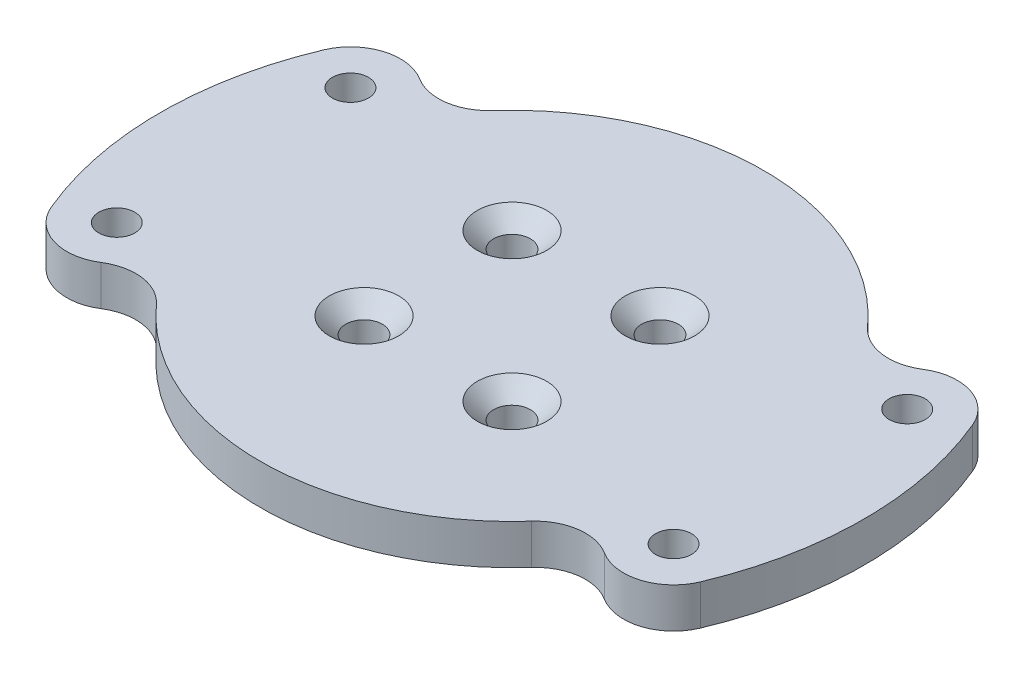
ISO-10303-21;
HEADER;
FILE_DESCRIPTION(('STEP AP214'),'2;1');
FILE_NAME('part.step','',(''),(''),'','','');
FILE_SCHEMA(('AUTOMOTIVE_DESIGN { 1 0 10303 214 1 1 1 1 }'));
ENDSEC;
DATA;
#1=APPLICATION_CONTEXT('core data for automotive mechanical design processes');
#2=APPLICATION_PROTOCOL_DEFINITION('international standard','automotive_design',2000,#1);
#3=PRODUCT_CONTEXT('',#1,'mechanical');
#4=PRODUCT('Part','Part','',(#3));
#5=PRODUCT_RELATED_PRODUCT_CATEGORY('part','',(#4));
#6=PRODUCT_DEFINITION_FORMATION('','',#4);
#7=PRODUCT_DEFINITION_CONTEXT('part definition',#1,'design');
#8=PRODUCT_DEFINITION('design','',#6,#7);
#9=PRODUCT_DEFINITION_SHAPE('','',#8);
#10=(LENGTH_UNIT() NAMED_UNIT(*) SI_UNIT(.MILLI.,.METRE.));
#11=(NAMED_UNIT(*) PLANE_ANGLE_UNIT() SI_UNIT($,.RADIAN.));
#12=(NAMED_UNIT(*) SI_UNIT($,.STERADIAN.) SOLID_ANGLE_UNIT());
#13=UNCERTAINTY_MEASURE_WITH_UNIT(LENGTH_MEASURE(1.E-05),#10,'distance_accuracy_value','');
#14=(GEOMETRIC_REPRESENTATION_CONTEXT(3) GLOBAL_UNCERTAINTY_ASSIGNED_CONTEXT((#13)) GLOBAL_UNIT_ASSIGNED_CONTEXT((#10,
#11,#12)) REPRESENTATION_CONTEXT('',''));
#15=CARTESIAN_POINT('',(0.,0.,0.));
#16=DIRECTION('',(0.,0.,1.));
#17=DIRECTION('',(1.,0.,0.));
#18=AXIS2_PLACEMENT_3D('',#15,#16,#17);
#19=CARTESIAN_POINT('',(0.,6.,0.));
#20=DIRECTION('',(0.,-1.,0.));
#21=DIRECTION('',(0.,0.,-1.));
#22=AXIS2_PLACEMENT_3D('',#19,#20,#21);
#23=PLANE('',#22);
#24=CARTESIAN_POINT('',(-11.0838987950992,6.,-11.0838987950991));
#25=DIRECTION('',(0.,1.,0.));
#26=DIRECTION('',(0.,0.,1.));
#27=AXIS2_PLACEMENT_3D('',#24,#25,#26);
#28=CIRCLE('',#27,5.2);
#29=CARTESIAN_POINT('',(-11.0838987950992,6.,-5.88389879509911));
#30=VERTEX_POINT('',#29);
#31=EDGE_CURVE('E543',#30,#30,#28,.T.);
#32=ORIENTED_EDGE('',*,*,#31,.F.);
#33=EDGE_LOOP('',(#32));
#34=FACE_BOUND('',#33,.T.);
#35=CARTESIAN_POINT('',(11.0838987950991,6.,-11.0838987950992));
#36=DIRECTION('',(0.,1.,0.));
#37=DIRECTION('',(0.,0.,1.));
#38=AXIS2_PLACEMENT_3D('',#35,#36,#37);
#39=CIRCLE('',#38,5.2);
#40=CARTESIAN_POINT('',(11.0838987950991,6.,-5.88389879509915));
#41=VERTEX_POINT('',#40);
#42=EDGE_CURVE('E550',#41,#41,#39,.T.);
#43=ORIENTED_EDGE('',*,*,#42,.F.);
#44=EDGE_LOOP('',(#43));
#45=FACE_BOUND('',#44,.T.);
#46=CARTESIAN_POINT('',(11.0838987950992,6.,11.0838987950991));
#47=DIRECTION('',(0.,1.,0.));
#48=DIRECTION('',(0.,0.,1.));
#49=AXIS2_PLACEMENT_3D('',#46,#47,#48);
#50=CIRCLE('',#49,5.2);
#51=CARTESIAN_POINT('',(11.0838987950992,6.,16.2838987950991));
#52=VERTEX_POINT('',#51);
#53=EDGE_CURVE('E559',#52,#52,#50,.T.);
#54=ORIENTED_EDGE('',*,*,#53,.F.);
#55=EDGE_LOOP('',(#54));
#56=FACE_BOUND('',#55,.T.);
#57=CARTESIAN_POINT('',(-11.0838987950991,6.,11.0838987950992));
#58=DIRECTION('',(0.,1.,0.));
#59=DIRECTION('',(0.,0.,1.));
#60=AXIS2_PLACEMENT_3D('',#57,#58,#59);
#61=CIRCLE('',#60,5.2);
#62=CARTESIAN_POINT('',(-11.0838987950991,6.,16.2838987950992));
#63=VERTEX_POINT('',#62);
#64=EDGE_CURVE('E227',#63,#63,#61,.T.);
#65=ORIENTED_EDGE('',*,*,#64,.F.);
#66=EDGE_LOOP('',(#65));
#67=FACE_BOUND('',#66,.T.);
#68=CARTESIAN_POINT('',(-41.7019259147584,6.,-17.5));
#69=DIRECTION('',(0.,1.,0.));
#70=DIRECTION('',(0.,0.,-1.));
#71=AXIS2_PLACEMENT_3D('',#68,#69,#70);
#72=CIRCLE('',#71,2.7);
#73=CARTESIAN_POINT('',(-41.7019259147584,6.,-20.2));
#74=VERTEX_POINT('',#73);
#75=EDGE_CURVE('E237',#74,#74,#72,.T.);
#76=ORIENTED_EDGE('',*,*,#75,.F.);
#77=EDGE_LOOP('',(#76));
#78=FACE_BOUND('',#77,.T.);
#79=CARTESIAN_POINT('',(0.,6.,0.));
#80=DIRECTION('',(0.,1.,0.));
#81=DIRECTION('',(0.,0.,1.));
#82=AXIS2_PLACEMENT_3D('',#79,#80,#81);
#83=CIRCLE('',#82,37.725);
#84=CARTESIAN_POINT('',(-28.0981033127079,6.,25.1728467843506));
#85=VERTEX_POINT('',#84);
#86=CARTESIAN_POINT('',(28.0981033127079,6.,25.1728467843506));
#87=VERTEX_POINT('',#86);
#88=EDGE_CURVE('E165',#85,#87,#83,.T.);
#89=ORIENTED_EDGE('',*,*,#88,.T.);
#90=CARTESIAN_POINT('',(33.6842073510197,6.,30.1773888885953));
#91=DIRECTION('',(0.,-1.,0.));
#92=DIRECTION('',(0.,0.,-1.));
#93=AXIS2_PLACEMENT_3D('',#90,#91,#92);
#94=CIRCLE('',#93,7.5);
#95=CARTESIAN_POINT('',(37.693066632889,6.,23.8386944442976));
#96=VERTEX_POINT('',#95);
#97=EDGE_CURVE('E52',#87,#96,#94,.T.);
#98=ORIENTED_EDGE('',*,*,#97,.T.);
#99=CARTESIAN_POINT('',(41.7019259147584,6.,17.5));
#100=DIRECTION('',(0.,-1.,0.));
#101=DIRECTION('',(0.,0.,-1.));
#102=AXIS2_PLACEMENT_3D('',#99,#100,#101);
#103=CIRCLE('',#102,7.5);
#104=CARTESIAN_POINT('',(48.6176681891794,6.,20.4021558872305));
#105=VERTEX_POINT('',#104);
#106=EDGE_CURVE('E181',#96,#105,#103,.F.);
#107=ORIENTED_EDGE('',*,*,#106,.T.);
#108=CARTESIAN_POINT('',(0.,6.,0.));
#109=DIRECTION('',(0.,1.,0.));
#110=DIRECTION('',(0.,0.,-1.));
#111=AXIS2_PLACEMENT_3D('',#108,#109,#110);
#112=CIRCLE('',#111,52.725);
#113=CARTESIAN_POINT('',(48.6176681891794,6.,-20.4021558872305));
#114=VERTEX_POINT('',#113);
#115=EDGE_CURVE('E147',#105,#114,#112,.T.);
#116=ORIENTED_EDGE('',*,*,#115,.T.);
#117=CARTESIAN_POINT('',(41.7019259147584,6.,-17.5));
#118=DIRECTION('',(0.,-1.,0.));
#119=DIRECTION('',(0.,0.,-1.));
#120=AXIS2_PLACEMENT_3D('',#117,#118,#119);
#121=CIRCLE('',#120,7.5);
#122=CARTESIAN_POINT('',(37.693066632889,6.,-23.8386944442976));
#123=VERTEX_POINT('',#122);
#124=EDGE_CURVE('E177',#114,#123,#121,.F.);
#125=ORIENTED_EDGE('',*,*,#124,.T.);
#126=CARTESIAN_POINT('',(33.6842073510197,6.,-30.1773888885953));
#127=DIRECTION('',(0.,-1.,0.));
#128=DIRECTION('',(0.,0.,-1.));
#129=AXIS2_PLACEMENT_3D('',#126,#127,#128);
#130=CIRCLE('',#129,7.5);
#131=CARTESIAN_POINT('',(28.0981033127079,6.,-25.1728467843506));
#132=VERTEX_POINT('',#131);
#133=EDGE_CURVE('E205',#123,#132,#130,.T.);
#134=ORIENTED_EDGE('',*,*,#133,.T.);
#135=CARTESIAN_POINT('',(0.,6.,0.));
#136=DIRECTION('',(0.,1.,0.));
#137=DIRECTION('',(0.,0.,-1.));
#138=AXIS2_PLACEMENT_3D('',#135,#136,#137);
#139=CIRCLE('',#138,37.725);
#140=CARTESIAN_POINT('',(-28.0981033127079,6.,-25.1728467843506));
#141=VERTEX_POINT('',#140);
#142=EDGE_CURVE('E251',#132,#141,#139,.T.);
#143=ORIENTED_EDGE('',*,*,#142,.T.);
#144=CARTESIAN_POINT('',(-33.6842073510197,6.,-30.1773888885953));
#145=DIRECTION('',(0.,-1.,0.));
#146=DIRECTION('',(0.,0.,-1.));
#147=AXIS2_PLACEMENT_3D('',#144,#145,#146);
#148=CIRCLE('',#147,7.5);
#149=CARTESIAN_POINT('',(-37.693066632889,6.,-23.8386944442976));
#150=VERTEX_POINT('',#149);
#151=EDGE_CURVE('E11',#141,#150,#148,.T.);
#152=ORIENTED_EDGE('',*,*,#151,.T.);
#153=CARTESIAN_POINT('',(-41.7019259147584,6.,-17.5));
#154=DIRECTION('',(0.,-1.,0.));
#155=DIRECTION('',(0.,0.,-1.));
#156=AXIS2_PLACEMENT_3D('',#153,#154,#155);
#157=CIRCLE('',#156,7.5);
#158=CARTESIAN_POINT('',(-48.6176681891794,6.,-20.4021558872305));
#159=VERTEX_POINT('',#158);
#160=EDGE_CURVE('E136',#150,#159,#157,.F.);
#161=ORIENTED_EDGE('',*,*,#160,.T.);
#162=CARTESIAN_POINT('',(0.,6.,0.));
#163=DIRECTION('',(0.,1.,0.));
#164=DIRECTION('',(0.,0.,1.));
#165=AXIS2_PLACEMENT_3D('',#162,#163,#164);
#166=CIRCLE('',#165,52.725);
#167=CARTESIAN_POINT('',(-48.6176681891794,6.,20.4021558872305));
#168=VERTEX_POINT('',#167);
#169=EDGE_CURVE('E253',#159,#168,#166,.T.);
#170=ORIENTED_EDGE('',*,*,#169,.T.);
#171=CARTESIAN_POINT('',(-41.7019259147584,6.,17.5));
#172=DIRECTION('',(0.,-1.,0.));
#173=DIRECTION('',(0.,0.,-1.));
#174=AXIS2_PLACEMENT_3D('',#171,#172,#173);
#175=CIRCLE('',#174,7.5);
#176=CARTESIAN_POINT('',(-37.693066632889,6.,23.8386944442976));
#177=VERTEX_POINT('',#176);
#178=EDGE_CURVE('E179',#168,#177,#175,.F.);
#179=ORIENTED_EDGE('',*,*,#178,.T.);
#180=CARTESIAN_POINT('',(-33.6842073510197,6.,30.1773888885953));
#181=DIRECTION('',(0.,-1.,0.));
#182=DIRECTION('',(0.,0.,-1.));
#183=AXIS2_PLACEMENT_3D('',#180,#181,#182);
#184=CIRCLE('',#183,7.5);
#185=EDGE_CURVE('E201',#177,#85,#184,.T.);
#186=ORIENTED_EDGE('',*,*,#185,.T.);
#187=EDGE_LOOP('',(#89,#98,#107,#116,#125,#134,#143,#152,#161,#170,#179,#186));
#188=FACE_BOUND('',#187,.T.);
#189=CARTESIAN_POINT('',(41.7019259147584,6.,-17.5));
#190=DIRECTION('',(0.,1.,0.));
#191=DIRECTION('',(0.,0.,1.));
#192=AXIS2_PLACEMENT_3D('',#189,#190,#191);
#193=CIRCLE('',#192,2.7);
#194=CARTESIAN_POINT('',(41.7019259147584,6.,-14.8));
#195=VERTEX_POINT('',#194);
#196=EDGE_CURVE('E156',#195,#195,#193,.T.);
#197=ORIENTED_EDGE('',*,*,#196,.F.);
#198=EDGE_LOOP('',(#197));
#199=FACE_BOUND('',#198,.T.);
#200=CARTESIAN_POINT('',(41.7019259147584,6.,17.5));
#201=DIRECTION('',(0.,1.,0.));
#202=DIRECTION('',(0.,0.,1.));
#203=AXIS2_PLACEMENT_3D('',#200,#201,#202);
#204=CIRCLE('',#203,2.7);
#205=CARTESIAN_POINT('',(41.7019259147584,6.,20.2));
#206=VERTEX_POINT('',#205);
#207=EDGE_CURVE('E243',#206,#206,#204,.T.);
#208=ORIENTED_EDGE('',*,*,#207,.F.);
#209=EDGE_LOOP('',(#208));
#210=FACE_BOUND('',#209,.T.);
#211=CARTESIAN_POINT('',(-41.7019259147584,6.,17.5));
#212=DIRECTION('',(0.,1.,0.));
#213=DIRECTION('',(0.,0.,-1.));
#214=AXIS2_PLACEMENT_3D('',#211,#212,#213);
#215=CIRCLE('',#214,2.7);
#216=CARTESIAN_POINT('',(-41.7019259147584,6.,14.8));
#217=VERTEX_POINT('',#216);
#218=EDGE_CURVE('E231',#217,#217,#215,.T.);
#219=ORIENTED_EDGE('',*,*,#218,.F.);
#220=EDGE_LOOP('',(#219));
#221=FACE_BOUND('',#220,.T.);
#222=ADVANCED_FACE('F35',(#34,#45,#56,#67,#78,#188,#199,#210,#221),#23,.F.);
#223=CARTESIAN_POINT('',(0.,0.,0.));
#224=DIRECTION('',(0.,-1.,0.));
#225=DIRECTION('',(0.,0.,-1.));
#226=AXIS2_PLACEMENT_3D('',#223,#224,#225);
#227=PLANE('',#226);
#228=CARTESIAN_POINT('',(-11.0838987950992,0.,-11.0838987950991));
#229=DIRECTION('',(0.,1.,0.));
#230=DIRECTION('',(0.,0.,1.));
#231=AXIS2_PLACEMENT_3D('',#228,#229,#230);
#232=CIRCLE('',#231,2.75);
#233=CARTESIAN_POINT('',(-11.0838987950992,0.,-8.33389879509911));
#234=VERTEX_POINT('',#233);
#235=EDGE_CURVE('E545',#234,#234,#232,.T.);
#236=ORIENTED_EDGE('',*,*,#235,.T.);
#237=EDGE_LOOP('',(#236));
#238=FACE_BOUND('',#237,.T.);
#239=CARTESIAN_POINT('',(11.0838987950991,0.,-11.0838987950992));
#240=DIRECTION('',(0.,1.,0.));
#241=DIRECTION('',(0.,0.,1.));
#242=AXIS2_PLACEMENT_3D('',#239,#240,#241);
#243=CIRCLE('',#242,2.75);
#244=CARTESIAN_POINT('',(11.0838987950991,0.,-8.33389879509916));
#245=VERTEX_POINT('',#244);
#246=EDGE_CURVE('E556',#245,#245,#243,.T.);
#247=ORIENTED_EDGE('',*,*,#246,.T.);
#248=EDGE_LOOP('',(#247));
#249=FACE_BOUND('',#248,.T.);
#250=CARTESIAN_POINT('',(11.0838987950992,0.,11.0838987950991));
#251=DIRECTION('',(0.,1.,0.));
#252=DIRECTION('',(0.,0.,1.));
#253=AXIS2_PLACEMENT_3D('',#250,#251,#252);
#254=CIRCLE('',#253,2.75);
#255=CARTESIAN_POINT('',(11.0838987950992,0.,13.8338987950991));
#256=VERTEX_POINT('',#255);
#257=EDGE_CURVE('E565',#256,#256,#254,.T.);
#258=ORIENTED_EDGE('',*,*,#257,.T.);
#259=EDGE_LOOP('',(#258));
#260=FACE_BOUND('',#259,.T.);
#261=CARTESIAN_POINT('',(-11.0838987950991,0.,11.0838987950992));
#262=DIRECTION('',(0.,1.,0.));
#263=DIRECTION('',(0.,0.,1.));
#264=AXIS2_PLACEMENT_3D('',#261,#262,#263);
#265=CIRCLE('',#264,2.75);
#266=CARTESIAN_POINT('',(-11.0838987950991,0.,13.8338987950992));
#267=VERTEX_POINT('',#266);
#268=EDGE_CURVE('E217',#267,#267,#265,.T.);
#269=ORIENTED_EDGE('',*,*,#268,.T.);
#270=EDGE_LOOP('',(#269));
#271=FACE_BOUND('',#270,.T.);
#272=CARTESIAN_POINT('',(-41.7019259147584,0.,-17.5));
#273=DIRECTION('',(0.,1.,0.));
#274=DIRECTION('',(0.,0.,-1.));
#275=AXIS2_PLACEMENT_3D('',#272,#273,#274);
#276=CIRCLE('',#275,2.7);
#277=CARTESIAN_POINT('',(-41.7019259147584,0.,-20.2));
#278=VERTEX_POINT('',#277);
#279=EDGE_CURVE('E234',#278,#278,#276,.T.);
#280=ORIENTED_EDGE('',*,*,#279,.T.);
#281=EDGE_LOOP('',(#280));
#282=FACE_BOUND('',#281,.T.);
#283=CARTESIAN_POINT('',(0.,0.,0.));
#284=DIRECTION('',(0.,1.,0.));
#285=DIRECTION('',(0.,0.,-1.));
#286=AXIS2_PLACEMENT_3D('',#283,#284,#285);
#287=CIRCLE('',#286,52.725);
#288=CARTESIAN_POINT('',(48.6176681891794,0.,20.4021558872305));
#289=VERTEX_POINT('',#288);
#290=CARTESIAN_POINT('',(48.6176681891794,0.,-20.4021558872305));
#291=VERTEX_POINT('',#290);
#292=EDGE_CURVE('E144',#289,#291,#287,.T.);
#293=ORIENTED_EDGE('',*,*,#292,.F.);
#294=CARTESIAN_POINT('',(41.7019259147584,0.,17.5));
#295=DIRECTION('',(0.,-1.,0.));
#296=DIRECTION('',(0.,0.,-1.));
#297=AXIS2_PLACEMENT_3D('',#294,#295,#296);
#298=CIRCLE('',#297,7.5);
#299=CARTESIAN_POINT('',(37.693066632889,0.,23.8386944442976));
#300=VERTEX_POINT('',#299);
#301=EDGE_CURVE('E127',#289,#300,#298,.T.);
#302=ORIENTED_EDGE('',*,*,#301,.T.);
#303=CARTESIAN_POINT('',(33.6842073510197,0.,30.1773888885953));
#304=DIRECTION('',(0.,-1.,0.));
#305=DIRECTION('',(0.,0.,-1.));
#306=AXIS2_PLACEMENT_3D('',#303,#304,#305);
#307=CIRCLE('',#306,7.5);
#308=CARTESIAN_POINT('',(28.0981033127079,0.,25.1728467843506));
#309=VERTEX_POINT('',#308);
#310=EDGE_CURVE('E196',#300,#309,#307,.F.);
#311=ORIENTED_EDGE('',*,*,#310,.T.);
#312=CARTESIAN_POINT('',(0.,0.,0.));
#313=DIRECTION('',(0.,1.,0.));
#314=DIRECTION('',(0.,0.,1.));
#315=AXIS2_PLACEMENT_3D('',#312,#313,#314);
#316=CIRCLE('',#315,37.725);
#317=CARTESIAN_POINT('',(-28.0981033127079,0.,25.1728467843506));
#318=VERTEX_POINT('',#317);
#319=EDGE_CURVE('E170',#318,#309,#316,.T.);
#320=ORIENTED_EDGE('',*,*,#319,.F.);
#321=CARTESIAN_POINT('',(-33.6842073510197,0.,30.1773888885953));
#322=DIRECTION('',(0.,-1.,0.));
#323=DIRECTION('',(0.,0.,-1.));
#324=AXIS2_PLACEMENT_3D('',#321,#322,#323);
#325=CIRCLE('',#324,7.5);
#326=CARTESIAN_POINT('',(-37.693066632889,0.,23.8386944442976));
#327=VERTEX_POINT('',#326);
#328=EDGE_CURVE('E199',#318,#327,#325,.F.);
#329=ORIENTED_EDGE('',*,*,#328,.T.);
#330=CARTESIAN_POINT('',(-41.7019259147584,0.,17.5));
#331=DIRECTION('',(0.,-1.,0.));
#332=DIRECTION('',(0.,0.,-1.));
#333=AXIS2_PLACEMENT_3D('',#330,#331,#332);
#334=CIRCLE('',#333,7.5);
#335=CARTESIAN_POINT('',(-48.6176681891794,0.,20.4021558872305));
#336=VERTEX_POINT('',#335);
#337=EDGE_CURVE('E137',#327,#336,#334,.T.);
#338=ORIENTED_EDGE('',*,*,#337,.T.);
#339=CARTESIAN_POINT('',(0.,0.,0.));
#340=DIRECTION('',(0.,1.,0.));
#341=DIRECTION('',(0.,0.,1.));
#342=AXIS2_PLACEMENT_3D('',#339,#340,#341);
#343=CIRCLE('',#342,52.725);
#344=CARTESIAN_POINT('',(-48.6176681891794,0.,-20.4021558872305));
#345=VERTEX_POINT('',#344);
#346=EDGE_CURVE('E159',#345,#336,#343,.T.);
#347=ORIENTED_EDGE('',*,*,#346,.F.);
#348=CARTESIAN_POINT('',(-41.7019259147584,0.,-17.5));
#349=DIRECTION('',(0.,-1.,0.));
#350=DIRECTION('',(0.,0.,-1.));
#351=AXIS2_PLACEMENT_3D('',#348,#349,#350);
#352=CIRCLE('',#351,7.5);
#353=CARTESIAN_POINT('',(-37.693066632889,0.,-23.8386944442976));
#354=VERTEX_POINT('',#353);
#355=EDGE_CURVE('E148',#345,#354,#352,.T.);
#356=ORIENTED_EDGE('',*,*,#355,.T.);
#357=CARTESIAN_POINT('',(-33.6842073510197,0.,-30.1773888885953));
#358=DIRECTION('',(0.,-1.,0.));
#359=DIRECTION('',(0.,0.,-1.));
#360=AXIS2_PLACEMENT_3D('',#357,#358,#359);
#361=CIRCLE('',#360,7.5);
#362=CARTESIAN_POINT('',(-28.0981033127079,0.,-25.1728467843506));
#363=VERTEX_POINT('',#362);
#364=EDGE_CURVE('E44',#354,#363,#361,.F.);
#365=ORIENTED_EDGE('',*,*,#364,.T.);
#366=CARTESIAN_POINT('',(0.,0.,0.));
#367=DIRECTION('',(0.,1.,0.));
#368=DIRECTION('',(0.,0.,-1.));
#369=AXIS2_PLACEMENT_3D('',#366,#367,#368);
#370=CIRCLE('',#369,37.725);
#371=CARTESIAN_POINT('',(28.0981033127079,0.,-25.1728467843506));
#372=VERTEX_POINT('',#371);
#373=EDGE_CURVE('E155',#372,#363,#370,.T.);
#374=ORIENTED_EDGE('',*,*,#373,.F.);
#375=CARTESIAN_POINT('',(33.6842073510197,0.,-30.1773888885953));
#376=DIRECTION('',(0.,-1.,0.));
#377=DIRECTION('',(0.,0.,-1.));
#378=AXIS2_PLACEMENT_3D('',#375,#376,#377);
#379=CIRCLE('',#378,7.5);
#380=CARTESIAN_POINT('',(37.693066632889,0.,-23.8386944442976));
#381=VERTEX_POINT('',#380);
#382=EDGE_CURVE('E203',#372,#381,#379,.F.);
#383=ORIENTED_EDGE('',*,*,#382,.T.);
#384=CARTESIAN_POINT('',(41.7019259147584,0.,-17.5));
#385=DIRECTION('',(0.,-1.,0.));
#386=DIRECTION('',(0.,0.,-1.));
#387=AXIS2_PLACEMENT_3D('',#384,#385,#386);
#388=CIRCLE('',#387,7.5);
#389=EDGE_CURVE('E154',#381,#291,#388,.T.);
#390=ORIENTED_EDGE('',*,*,#389,.T.);
#391=EDGE_LOOP('',(#293,#302,#311,#320,#329,#338,#347,#356,#365,#374,#383,#390));
#392=FACE_BOUND('',#391,.T.);
#393=CARTESIAN_POINT('',(41.7019259147584,0.,-17.5));
#394=DIRECTION('',(0.,1.,0.));
#395=DIRECTION('',(0.,0.,1.));
#396=AXIS2_PLACEMENT_3D('',#393,#394,#395);
#397=CIRCLE('',#396,2.7);
#398=CARTESIAN_POINT('',(41.7019259147584,0.,-14.8));
#399=VERTEX_POINT('',#398);
#400=EDGE_CURVE('E162',#399,#399,#397,.T.);
#401=ORIENTED_EDGE('',*,*,#400,.T.);
#402=EDGE_LOOP('',(#401));
#403=FACE_BOUND('',#402,.T.);
#404=CARTESIAN_POINT('',(41.7019259147584,0.,17.5));
#405=DIRECTION('',(0.,1.,0.));
#406=DIRECTION('',(0.,0.,1.));
#407=AXIS2_PLACEMENT_3D('',#404,#405,#406);
#408=CIRCLE('',#407,2.7);
#409=CARTESIAN_POINT('',(41.7019259147584,0.,20.2));
#410=VERTEX_POINT('',#409);
#411=EDGE_CURVE('E240',#410,#410,#408,.T.);
#412=ORIENTED_EDGE('',*,*,#411,.T.);
#413=EDGE_LOOP('',(#412));
#414=FACE_BOUND('',#413,.T.);
#415=CARTESIAN_POINT('',(-41.7019259147584,0.,17.5));
#416=DIRECTION('',(0.,1.,0.));
#417=DIRECTION('',(0.,0.,-1.));
#418=AXIS2_PLACEMENT_3D('',#415,#416,#417);
#419=CIRCLE('',#418,2.7);
#420=CARTESIAN_POINT('',(-41.7019259147584,0.,14.8));
#421=VERTEX_POINT('',#420);
#422=EDGE_CURVE('E209',#421,#421,#419,.T.);
#423=ORIENTED_EDGE('',*,*,#422,.T.);
#424=EDGE_LOOP('',(#423));
#425=FACE_BOUND('',#424,.T.);
#426=ADVANCED_FACE('F151',(#238,#249,#260,#271,#282,#392,#403,#414,#425),#227,.T.);
#427=CARTESIAN_POINT('',(0.,6.,0.));
#428=DIRECTION('',(0.,-1.,0.));
#429=DIRECTION('',(0.,0.,-1.));
#430=AXIS2_PLACEMENT_3D('',#427,#428,#429);
#431=CYLINDRICAL_SURFACE('',#430,52.725);
#432=ORIENTED_EDGE('',*,*,#115,.F.);
#433=DIRECTION('',(0.,-1.,0.));
#434=VECTOR('',#433,1.);
#435=CARTESIAN_POINT('',(48.6176681891794,6.,20.4021558872305));
#436=LINE('',#435,#434);
#437=EDGE_CURVE('E131',#105,#289,#436,.T.);
#438=ORIENTED_EDGE('',*,*,#437,.T.);
#439=ORIENTED_EDGE('',*,*,#292,.T.);
#440=DIRECTION('',(0.,-1.,0.));
#441=VECTOR('',#440,1.);
#442=CARTESIAN_POINT('',(48.6176681891794,6.,-20.4021558872305));
#443=LINE('',#442,#441);
#444=EDGE_CURVE('E149',#291,#114,#443,.F.);
#445=ORIENTED_EDGE('',*,*,#444,.T.);
#446=EDGE_LOOP('',(#432,#438,#439,#445));
#447=FACE_BOUND('',#446,.T.);
#448=ADVANCED_FACE('F142',(#447),#431,.T.);
#449=CARTESIAN_POINT('',(0.,6.,0.));
#450=DIRECTION('',(0.,-1.,0.));
#451=DIRECTION('',(0.,0.,-1.));
#452=AXIS2_PLACEMENT_3D('',#449,#450,#451);
#453=CYLINDRICAL_SURFACE('',#452,37.725);
#454=ORIENTED_EDGE('',*,*,#142,.F.);
#455=DIRECTION('',(0.,-1.,0.));
#456=VECTOR('',#455,1.);
#457=CARTESIAN_POINT('',(28.0981033127079,6.,-25.1728467843506));
#458=LINE('',#457,#456);
#459=EDGE_CURVE('E194',#132,#372,#458,.T.);
#460=ORIENTED_EDGE('',*,*,#459,.T.);
#461=ORIENTED_EDGE('',*,*,#373,.T.);
#462=DIRECTION('',(0.,-1.,0.));
#463=VECTOR('',#462,1.);
#464=CARTESIAN_POINT('',(-28.0981033127079,6.,-25.1728467843506));
#465=LINE('',#464,#463);
#466=EDGE_CURVE('E192',#363,#141,#465,.F.);
#467=ORIENTED_EDGE('',*,*,#466,.T.);
#468=EDGE_LOOP('',(#454,#460,#461,#467));
#469=FACE_BOUND('',#468,.T.);
#470=ADVANCED_FACE('F269',(#469),#453,.T.);
#471=CARTESIAN_POINT('',(0.,6.,0.));
#472=DIRECTION('',(0.,-1.,0.));
#473=DIRECTION('',(0.,0.,-1.));
#474=AXIS2_PLACEMENT_3D('',#471,#472,#473);
#475=CYLINDRICAL_SURFACE('',#474,52.725);
#476=ORIENTED_EDGE('',*,*,#346,.T.);
#477=DIRECTION('',(0.,-1.,0.));
#478=VECTOR('',#477,1.);
#479=CARTESIAN_POINT('',(-48.6176681891794,6.,20.4021558872305));
#480=LINE('',#479,#478);
#481=EDGE_CURVE('E189',#336,#168,#480,.F.);
#482=ORIENTED_EDGE('',*,*,#481,.T.);
#483=ORIENTED_EDGE('',*,*,#169,.F.);
#484=DIRECTION('',(0.,-1.,0.));
#485=VECTOR('',#484,1.);
#486=CARTESIAN_POINT('',(-48.6176681891794,6.,-20.4021558872305));
#487=LINE('',#486,#485);
#488=EDGE_CURVE('E186',#159,#345,#487,.T.);
#489=ORIENTED_EDGE('',*,*,#488,.T.);
#490=EDGE_LOOP('',(#476,#482,#483,#489));
#491=FACE_BOUND('',#490,.T.);
#492=ADVANCED_FACE('F277',(#491),#475,.T.);
#493=CARTESIAN_POINT('',(0.,6.,0.));
#494=DIRECTION('',(0.,-1.,0.));
#495=DIRECTION('',(0.,0.,-1.));
#496=AXIS2_PLACEMENT_3D('',#493,#494,#495);
#497=CYLINDRICAL_SURFACE('',#496,37.725);
#498=ORIENTED_EDGE('',*,*,#319,.T.);
#499=DIRECTION('',(0.,-1.,0.));
#500=VECTOR('',#499,1.);
#501=CARTESIAN_POINT('',(28.0981033127079,6.,25.1728467843506));
#502=LINE('',#501,#500);
#503=EDGE_CURVE('E60',#309,#87,#502,.F.);
#504=ORIENTED_EDGE('',*,*,#503,.T.);
#505=ORIENTED_EDGE('',*,*,#88,.F.);
#506=DIRECTION('',(0.,-1.,0.));
#507=VECTOR('',#506,1.);
#508=CARTESIAN_POINT('',(-28.0981033127079,6.,25.1728467843506));
#509=LINE('',#508,#507);
#510=EDGE_CURVE('E183',#85,#318,#509,.T.);
#511=ORIENTED_EDGE('',*,*,#510,.T.);
#512=EDGE_LOOP('',(#498,#504,#505,#511));
#513=FACE_BOUND('',#512,.T.);
#514=ADVANCED_FACE('F305',(#513),#497,.T.);
#515=CARTESIAN_POINT('',(41.7019259147584,6.,-17.5));
#516=DIRECTION('',(0.,-1.,0.));
#517=DIRECTION('',(0.,0.,-1.));
#518=AXIS2_PLACEMENT_3D('',#515,#516,#517);
#519=CYLINDRICAL_SURFACE('',#518,2.7);
#520=ORIENTED_EDGE('',*,*,#196,.T.);
#521=EDGE_LOOP('',(#520));
#522=FACE_BOUND('',#521,.T.);
#523=ORIENTED_EDGE('',*,*,#400,.F.);
#524=EDGE_LOOP('',(#523));
#525=FACE_BOUND('',#524,.T.);
#526=ADVANCED_FACE('F302',(#522,#525),#519,.F.);
#527=CARTESIAN_POINT('',(41.7019259147584,6.,17.5));
#528=DIRECTION('',(0.,-1.,0.));
#529=DIRECTION('',(0.,0.,-1.));
#530=AXIS2_PLACEMENT_3D('',#527,#528,#529);
#531=CYLINDRICAL_SURFACE('',#530,2.7);
#532=ORIENTED_EDGE('',*,*,#207,.T.);
#533=EDGE_LOOP('',(#532));
#534=FACE_BOUND('',#533,.T.);
#535=ORIENTED_EDGE('',*,*,#411,.F.);
#536=EDGE_LOOP('',(#535));
#537=FACE_BOUND('',#536,.T.);
#538=ADVANCED_FACE('F443',(#534,#537),#531,.F.);
#539=CARTESIAN_POINT('',(-41.7019259147584,6.,-17.5));
#540=DIRECTION('',(0.,-1.,0.));
#541=DIRECTION('',(0.,0.,-1.));
#542=AXIS2_PLACEMENT_3D('',#539,#540,#541);
#543=CYLINDRICAL_SURFACE('',#542,2.7);
#544=ORIENTED_EDGE('',*,*,#75,.T.);
#545=EDGE_LOOP('',(#544));
#546=FACE_BOUND('',#545,.T.);
#547=ORIENTED_EDGE('',*,*,#279,.F.);
#548=EDGE_LOOP('',(#547));
#549=FACE_BOUND('',#548,.T.);
#550=ADVANCED_FACE('F440',(#546,#549),#543,.F.);
#551=CARTESIAN_POINT('',(-41.7019259147584,6.,17.5));
#552=DIRECTION('',(0.,-1.,0.));
#553=DIRECTION('',(0.,0.,-1.));
#554=AXIS2_PLACEMENT_3D('',#551,#552,#553);
#555=CYLINDRICAL_SURFACE('',#554,2.7);
#556=ORIENTED_EDGE('',*,*,#218,.T.);
#557=EDGE_LOOP('',(#556));
#558=FACE_BOUND('',#557,.T.);
#559=ORIENTED_EDGE('',*,*,#422,.F.);
#560=EDGE_LOOP('',(#559));
#561=FACE_BOUND('',#560,.T.);
#562=ADVANCED_FACE('F319',(#558,#561),#555,.F.);
#563=CARTESIAN_POINT('',(33.6842073510197,6.,30.1773888885953));
#564=DIRECTION('',(0.,-1.,0.));
#565=DIRECTION('',(0.,0.,-1.));
#566=AXIS2_PLACEMENT_3D('',#563,#564,#565);
#567=CYLINDRICAL_SURFACE('',#566,7.5);
#568=DIRECTION('',(0.,1.,0.));
#569=VECTOR('',#568,1.);
#570=CARTESIAN_POINT('',(37.693066632889,0.,23.8386944442976));
#571=LINE('',#570,#569);
#572=EDGE_CURVE('E132',#96,#300,#571,.F.);
#573=ORIENTED_EDGE('',*,*,#572,.F.);
#574=ORIENTED_EDGE('',*,*,#97,.F.);
#575=ORIENTED_EDGE('',*,*,#503,.F.);
#576=ORIENTED_EDGE('',*,*,#310,.F.);
#577=EDGE_LOOP('',(#573,#574,#575,#576));
#578=FACE_BOUND('',#577,.T.);
#579=ADVANCED_FACE('F260',(#578),#567,.F.);
#580=CARTESIAN_POINT('',(41.7019259147584,6.,17.5));
#581=DIRECTION('',(0.,-1.,0.));
#582=DIRECTION('',(0.,0.,-1.));
#583=AXIS2_PLACEMENT_3D('',#580,#581,#582);
#584=CYLINDRICAL_SURFACE('',#583,7.5);
#585=ORIENTED_EDGE('',*,*,#106,.F.);
#586=ORIENTED_EDGE('',*,*,#572,.T.);
#587=ORIENTED_EDGE('',*,*,#301,.F.);
#588=ORIENTED_EDGE('',*,*,#437,.F.);
#589=EDGE_LOOP('',(#585,#586,#587,#588));
#590=FACE_BOUND('',#589,.T.);
#591=ADVANCED_FACE('F130',(#590),#584,.T.);
#592=CARTESIAN_POINT('',(-33.6842073510197,6.,30.1773888885953));
#593=DIRECTION('',(0.,-1.,0.));
#594=DIRECTION('',(0.,0.,-1.));
#595=AXIS2_PLACEMENT_3D('',#592,#593,#594);
#596=CYLINDRICAL_SURFACE('',#595,7.5);
#597=ORIENTED_EDGE('',*,*,#510,.F.);
#598=ORIENTED_EDGE('',*,*,#185,.F.);
#599=DIRECTION('',(0.,1.,0.));
#600=VECTOR('',#599,1.);
#601=CARTESIAN_POINT('',(-37.693066632889,6.,23.8386944442976));
#602=LINE('',#601,#600);
#603=EDGE_CURVE('E210',#327,#177,#602,.T.);
#604=ORIENTED_EDGE('',*,*,#603,.F.);
#605=ORIENTED_EDGE('',*,*,#328,.F.);
#606=EDGE_LOOP('',(#597,#598,#604,#605));
#607=FACE_BOUND('',#606,.T.);
#608=ADVANCED_FACE('F316',(#607),#596,.F.);
#609=CARTESIAN_POINT('',(-41.7019259147584,6.,17.5));
#610=DIRECTION('',(0.,-1.,0.));
#611=DIRECTION('',(0.,0.,-1.));
#612=AXIS2_PLACEMENT_3D('',#609,#610,#611);
#613=CYLINDRICAL_SURFACE('',#612,7.5);
#614=ORIENTED_EDGE('',*,*,#178,.F.);
#615=ORIENTED_EDGE('',*,*,#481,.F.);
#616=ORIENTED_EDGE('',*,*,#337,.F.);
#617=ORIENTED_EDGE('',*,*,#603,.T.);
#618=EDGE_LOOP('',(#614,#615,#616,#617));
#619=FACE_BOUND('',#618,.T.);
#620=ADVANCED_FACE('F320',(#619),#613,.T.);
#621=CARTESIAN_POINT('',(33.6842073510197,6.,-30.1773888885953));
#622=DIRECTION('',(0.,-1.,0.));
#623=DIRECTION('',(0.,0.,-1.));
#624=AXIS2_PLACEMENT_3D('',#621,#622,#623);
#625=CYLINDRICAL_SURFACE('',#624,7.5);
#626=ORIENTED_EDGE('',*,*,#459,.F.);
#627=ORIENTED_EDGE('',*,*,#133,.F.);
#628=DIRECTION('',(0.,1.,0.));
#629=VECTOR('',#628,1.);
#630=CARTESIAN_POINT('',(37.693066632889,6.,-23.8386944442976));
#631=LINE('',#630,#629);
#632=EDGE_CURVE('E212',#381,#123,#631,.T.);
#633=ORIENTED_EDGE('',*,*,#632,.F.);
#634=ORIENTED_EDGE('',*,*,#382,.F.);
#635=EDGE_LOOP('',(#626,#627,#633,#634));
#636=FACE_BOUND('',#635,.T.);
#637=ADVANCED_FACE('F265',(#636),#625,.F.);
#638=CARTESIAN_POINT('',(41.7019259147584,6.,-17.5));
#639=DIRECTION('',(0.,-1.,0.));
#640=DIRECTION('',(0.,0.,-1.));
#641=AXIS2_PLACEMENT_3D('',#638,#639,#640);
#642=CYLINDRICAL_SURFACE('',#641,7.5);
#643=ORIENTED_EDGE('',*,*,#124,.F.);
#644=ORIENTED_EDGE('',*,*,#444,.F.);
#645=ORIENTED_EDGE('',*,*,#389,.F.);
#646=ORIENTED_EDGE('',*,*,#632,.T.);
#647=EDGE_LOOP('',(#643,#644,#645,#646));
#648=FACE_BOUND('',#647,.T.);
#649=ADVANCED_FACE('F289',(#648),#642,.T.);
#650=CARTESIAN_POINT('',(-33.6842073510197,6.,-30.1773888885953));
#651=DIRECTION('',(0.,-1.,0.));
#652=DIRECTION('',(0.,0.,-1.));
#653=AXIS2_PLACEMENT_3D('',#650,#651,#652);
#654=CYLINDRICAL_SURFACE('',#653,7.5);
#655=DIRECTION('',(0.,1.,0.));
#656=VECTOR('',#655,1.);
#657=CARTESIAN_POINT('',(-37.693066632889,0.,-23.8386944442976));
#658=LINE('',#657,#656);
#659=EDGE_CURVE('E39',#150,#354,#658,.F.);
#660=ORIENTED_EDGE('',*,*,#659,.F.);
#661=ORIENTED_EDGE('',*,*,#151,.F.);
#662=ORIENTED_EDGE('',*,*,#466,.F.);
#663=ORIENTED_EDGE('',*,*,#364,.F.);
#664=EDGE_LOOP('',(#660,#661,#662,#663));
#665=FACE_BOUND('',#664,.T.);
#666=ADVANCED_FACE('F37',(#665),#654,.F.);
#667=CARTESIAN_POINT('',(-41.7019259147584,6.,-17.5));
#668=DIRECTION('',(0.,-1.,0.));
#669=DIRECTION('',(0.,0.,-1.));
#670=AXIS2_PLACEMENT_3D('',#667,#668,#669);
#671=CYLINDRICAL_SURFACE('',#670,7.5);
#672=ORIENTED_EDGE('',*,*,#160,.F.);
#673=ORIENTED_EDGE('',*,*,#659,.T.);
#674=ORIENTED_EDGE('',*,*,#355,.F.);
#675=ORIENTED_EDGE('',*,*,#488,.F.);
#676=EDGE_LOOP('',(#672,#673,#674,#675));
#677=FACE_BOUND('',#676,.T.);
#678=ADVANCED_FACE('F279',(#677),#671,.T.);
#679=CARTESIAN_POINT('',(-11.0838987950991,6.,11.0838987950992));
#680=DIRECTION('',(0.,1.,0.));
#681=DIRECTION('',(0.,0.,1.));
#682=AXIS2_PLACEMENT_3D('',#679,#680,#681);
#683=CYLINDRICAL_SURFACE('',#682,2.75);
#684=ORIENTED_EDGE('',*,*,#268,.F.);
#685=EDGE_LOOP('',(#684));
#686=FACE_BOUND('',#685,.T.);
#687=CARTESIAN_POINT('',(-11.0838987950991,3.55,11.0838987950992));
#688=DIRECTION('',(0.,1.,0.));
#689=DIRECTION('',(0.,0.,1.));
#690=AXIS2_PLACEMENT_3D('',#687,#688,#689);
#691=CIRCLE('',#690,2.75);
#692=CARTESIAN_POINT('',(-11.0838987950991,3.55,13.8338987950992));
#693=VERTEX_POINT('',#692);
#694=EDGE_CURVE('E222',#693,#693,#691,.T.);
#695=ORIENTED_EDGE('',*,*,#694,.T.);
#696=EDGE_LOOP('',(#695));
#697=FACE_BOUND('',#696,.T.);
#698=ADVANCED_FACE('F281',(#686,#697),#683,.F.);
#699=CARTESIAN_POINT('',(-11.0838987950991,6.,11.0838987950992));
#700=DIRECTION('',(0.,1.,0.));
#701=DIRECTION('',(0.,0.,1.));
#702=AXIS2_PLACEMENT_3D('',#699,#700,#701);
#703=CONICAL_SURFACE('',#702,5.2,0.785398163397449);
#704=ORIENTED_EDGE('',*,*,#694,.F.);
#705=EDGE_LOOP('',(#704));
#706=FACE_BOUND('',#705,.T.);
#707=ORIENTED_EDGE('',*,*,#64,.T.);
#708=EDGE_LOOP('',(#707));
#709=FACE_BOUND('',#708,.T.);
#710=ADVANCED_FACE('F286',(#706,#709),#703,.F.);
#711=CARTESIAN_POINT('',(11.0838987950992,6.,11.0838987950991));
#712=DIRECTION('',(0.,1.,0.));
#713=DIRECTION('',(0.,0.,1.));
#714=AXIS2_PLACEMENT_3D('',#711,#712,#713);
#715=CYLINDRICAL_SURFACE('',#714,2.75);
#716=ORIENTED_EDGE('',*,*,#257,.F.);
#717=EDGE_LOOP('',(#716));
#718=FACE_BOUND('',#717,.T.);
#719=CARTESIAN_POINT('',(11.0838987950992,3.55,11.0838987950991));
#720=DIRECTION('',(0.,1.,0.));
#721=DIRECTION('',(0.,0.,1.));
#722=AXIS2_PLACEMENT_3D('',#719,#720,#721);
#723=CIRCLE('',#722,2.75);
#724=CARTESIAN_POINT('',(11.0838987950992,3.55,13.8338987950991));
#725=VERTEX_POINT('',#724);
#726=EDGE_CURVE('E562',#725,#725,#723,.T.);
#727=ORIENTED_EDGE('',*,*,#726,.T.);
#728=EDGE_LOOP('',(#727));
#729=FACE_BOUND('',#728,.T.);
#730=ADVANCED_FACE('F371',(#718,#729),#715,.F.);
#731=CARTESIAN_POINT('',(11.0838987950992,6.,11.0838987950991));
#732=DIRECTION('',(0.,1.,0.));
#733=DIRECTION('',(0.,0.,1.));
#734=AXIS2_PLACEMENT_3D('',#731,#732,#733);
#735=CONICAL_SURFACE('',#734,5.2,0.785398163397449);
#736=ORIENTED_EDGE('',*,*,#726,.F.);
#737=EDGE_LOOP('',(#736));
#738=FACE_BOUND('',#737,.T.);
#739=ORIENTED_EDGE('',*,*,#53,.T.);
#740=EDGE_LOOP('',(#739));
#741=FACE_BOUND('',#740,.T.);
#742=ADVANCED_FACE('F381',(#738,#741),#735,.F.);
#743=CARTESIAN_POINT('',(11.0838987950991,6.,-11.0838987950992));
#744=DIRECTION('',(0.,1.,0.));
#745=DIRECTION('',(0.,0.,1.));
#746=AXIS2_PLACEMENT_3D('',#743,#744,#745);
#747=CYLINDRICAL_SURFACE('',#746,2.75);
#748=ORIENTED_EDGE('',*,*,#246,.F.);
#749=EDGE_LOOP('',(#748));
#750=FACE_BOUND('',#749,.T.);
#751=CARTESIAN_POINT('',(11.0838987950991,3.55,-11.0838987950992));
#752=DIRECTION('',(0.,1.,0.));
#753=DIRECTION('',(0.,0.,1.));
#754=AXIS2_PLACEMENT_3D('',#751,#752,#753);
#755=CIRCLE('',#754,2.75);
#756=CARTESIAN_POINT('',(11.0838987950991,3.55,-8.33389879509916));
#757=VERTEX_POINT('',#756);
#758=EDGE_CURVE('E553',#757,#757,#755,.T.);
#759=ORIENTED_EDGE('',*,*,#758,.T.);
#760=EDGE_LOOP('',(#759));
#761=FACE_BOUND('',#760,.T.);
#762=ADVANCED_FACE('F391',(#750,#761),#747,.F.);
#763=CARTESIAN_POINT('',(11.0838987950991,6.,-11.0838987950992));
#764=DIRECTION('',(0.,1.,0.));
#765=DIRECTION('',(0.,0.,1.));
#766=AXIS2_PLACEMENT_3D('',#763,#764,#765);
#767=CONICAL_SURFACE('',#766,5.2,0.785398163397449);
#768=ORIENTED_EDGE('',*,*,#758,.F.);
#769=EDGE_LOOP('',(#768));
#770=FACE_BOUND('',#769,.T.);
#771=ORIENTED_EDGE('',*,*,#42,.T.);
#772=EDGE_LOOP('',(#771));
#773=FACE_BOUND('',#772,.T.);
#774=ADVANCED_FACE('F401',(#770,#773),#767,.F.);
#775=CARTESIAN_POINT('',(-11.0838987950992,6.,-11.0838987950991));
#776=DIRECTION('',(0.,1.,0.));
#777=DIRECTION('',(0.,0.,1.));
#778=AXIS2_PLACEMENT_3D('',#775,#776,#777);
#779=CYLINDRICAL_SURFACE('',#778,2.75);
#780=ORIENTED_EDGE('',*,*,#235,.F.);
#781=EDGE_LOOP('',(#780));
#782=FACE_BOUND('',#781,.T.);
#783=CARTESIAN_POINT('',(-11.0838987950992,3.55,-11.0838987950991));
#784=DIRECTION('',(0.,1.,0.));
#785=DIRECTION('',(0.,0.,1.));
#786=AXIS2_PLACEMENT_3D('',#783,#784,#785);
#787=CIRCLE('',#786,2.75);
#788=CARTESIAN_POINT('',(-11.0838987950992,3.55,-8.33389879509911));
#789=VERTEX_POINT('',#788);
#790=EDGE_CURVE('E541',#789,#789,#787,.T.);
#791=ORIENTED_EDGE('',*,*,#790,.T.);
#792=EDGE_LOOP('',(#791));
#793=FACE_BOUND('',#792,.T.);
#794=ADVANCED_FACE('F411',(#782,#793),#779,.F.);
#795=CARTESIAN_POINT('',(-11.0838987950992,6.,-11.0838987950991));
#796=DIRECTION('',(0.,1.,0.));
#797=DIRECTION('',(0.,0.,1.));
#798=AXIS2_PLACEMENT_3D('',#795,#796,#797);
#799=CONICAL_SURFACE('',#798,5.2,0.785398163397449);
#800=ORIENTED_EDGE('',*,*,#790,.F.);
#801=EDGE_LOOP('',(#800));
#802=FACE_BOUND('',#801,.T.);
#803=ORIENTED_EDGE('',*,*,#31,.T.);
#804=EDGE_LOOP('',(#803));
#805=FACE_BOUND('',#804,.T.);
#806=ADVANCED_FACE('F421',(#802,#805),#799,.F.);
#807=CLOSED_SHELL('',(#222,#426,#448,#470,#492,#514,#526,#538,#550,#562,#579,#591,#608,#620,
#637,#649,#666,#678,#698,#710,#730,#742,#762,#774,#794,#806));
#808=MANIFOLD_SOLID_BREP('B2',#807);
#809=ADVANCED_BREP_SHAPE_REPRESENTATION('',(#18,#808),#14);
#810=SHAPE_DEFINITION_REPRESENTATION(#9,#809);
ENDSEC;
END-ISO-10303-21;
